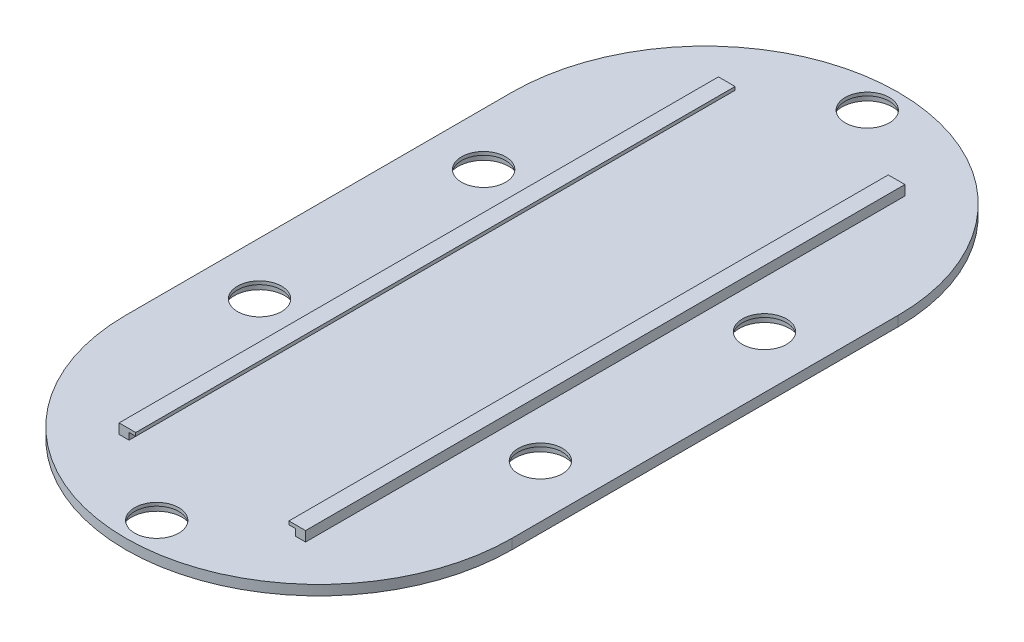
ISO-10303-21;
HEADER;
FILE_DESCRIPTION(('STEP AP214'),'2;1');
FILE_NAME('part.step','',(''),(''),'','','');
FILE_SCHEMA(('AUTOMOTIVE_DESIGN { 1 0 10303 214 1 1 1 1 }'));
ENDSEC;
DATA;
#1=APPLICATION_CONTEXT('core data for automotive mechanical design processes');
#2=APPLICATION_PROTOCOL_DEFINITION('international standard','automotive_design',2000,#1);
#3=PRODUCT_CONTEXT('',#1,'mechanical');
#4=PRODUCT('Part','Part','',(#3));
#5=PRODUCT_RELATED_PRODUCT_CATEGORY('part','',(#4));
#6=PRODUCT_DEFINITION_FORMATION('','',#4);
#7=PRODUCT_DEFINITION_CONTEXT('part definition',#1,'design');
#8=PRODUCT_DEFINITION('design','',#6,#7);
#9=PRODUCT_DEFINITION_SHAPE('','',#8);
#10=(LENGTH_UNIT() NAMED_UNIT(*) SI_UNIT(.MILLI.,.METRE.));
#11=(NAMED_UNIT(*) PLANE_ANGLE_UNIT() SI_UNIT($,.RADIAN.));
#12=(NAMED_UNIT(*) SI_UNIT($,.STERADIAN.) SOLID_ANGLE_UNIT());
#13=UNCERTAINTY_MEASURE_WITH_UNIT(LENGTH_MEASURE(1.E-05),#10,'distance_accuracy_value','');
#14=(GEOMETRIC_REPRESENTATION_CONTEXT(3) GLOBAL_UNCERTAINTY_ASSIGNED_CONTEXT((#13)) GLOBAL_UNIT_ASSIGNED_CONTEXT((#10,
#11,#12)) REPRESENTATION_CONTEXT('',''));
#15=CARTESIAN_POINT('',(0.,0.,0.));
#16=DIRECTION('',(0.,0.,1.));
#17=DIRECTION('',(1.,0.,0.));
#18=AXIS2_PLACEMENT_3D('',#15,#16,#17);
#19=CARTESIAN_POINT('',(0.,3.,58.));
#20=DIRECTION('',(0.,-1.,0.));
#21=DIRECTION('',(0.,0.,-1.));
#22=AXIS2_PLACEMENT_3D('',#19,#20,#21);
#23=PLANE('',#22);
#24=CARTESIAN_POINT('',(42.175,3.,33.6502523969275));
#25=DIRECTION('',(0.,1.,0.));
#26=DIRECTION('',(0.,0.,-1.));
#27=AXIS2_PLACEMENT_3D('',#24,#25,#26);
#28=CIRCLE('',#27,6.625);
#29=CARTESIAN_POINT('',(42.175,3.,27.0252523969275));
#30=VERTEX_POINT('',#29);
#31=EDGE_CURVE('E299',#30,#30,#28,.T.);
#32=ORIENTED_EDGE('',*,*,#31,.F.);
#33=EDGE_LOOP('',(#32));
#34=FACE_BOUND('',#33,.T.);
#35=CARTESIAN_POINT('',(0.,3.,106.699495206145));
#36=DIRECTION('',(0.,1.,0.));
#37=DIRECTION('',(0.,0.,-1.));
#38=AXIS2_PLACEMENT_3D('',#35,#36,#37);
#39=CIRCLE('',#38,6.62500000000002);
#40=CARTESIAN_POINT('',(0.,3.,100.074495206145));
#41=VERTEX_POINT('',#40);
#42=EDGE_CURVE('E303',#41,#41,#39,.T.);
#43=ORIENTED_EDGE('',*,*,#42,.F.);
#44=EDGE_LOOP('',(#43));
#45=FACE_BOUND('',#44,.T.);
#46=CARTESIAN_POINT('',(-42.175,3.,-33.6502523969275));
#47=DIRECTION('',(0.,1.,0.));
#48=DIRECTION('',(0.,0.,1.));
#49=AXIS2_PLACEMENT_3D('',#46,#47,#48);
#50=CIRCLE('',#49,6.62500000000001);
#51=CARTESIAN_POINT('',(-42.175,3.,-27.0252523969275));
#52=VERTEX_POINT('',#51);
#53=EDGE_CURVE('E307',#52,#52,#50,.T.);
#54=ORIENTED_EDGE('',*,*,#53,.F.);
#55=EDGE_LOOP('',(#54));
#56=FACE_BOUND('',#55,.T.);
#57=CARTESIAN_POINT('',(42.175,3.,-33.6502523969275));
#58=DIRECTION('',(0.,1.,0.));
#59=DIRECTION('',(0.,0.,1.));
#60=AXIS2_PLACEMENT_3D('',#57,#58,#59);
#61=CIRCLE('',#60,6.625);
#62=CARTESIAN_POINT('',(42.175,3.,-27.0252523969275));
#63=VERTEX_POINT('',#62);
#64=EDGE_CURVE('E311',#63,#63,#61,.T.);
#65=ORIENTED_EDGE('',*,*,#64,.F.);
#66=EDGE_LOOP('',(#65));
#67=FACE_BOUND('',#66,.T.);
#68=CARTESIAN_POINT('',(-42.175,3.,33.6502523969275));
#69=DIRECTION('',(0.,1.,0.));
#70=DIRECTION('',(0.,0.,-1.));
#71=AXIS2_PLACEMENT_3D('',#68,#69,#70);
#72=CIRCLE('',#71,6.62500000000001);
#73=CARTESIAN_POINT('',(-42.175,3.,27.0252523969275));
#74=VERTEX_POINT('',#73);
#75=EDGE_CURVE('E315',#74,#74,#72,.T.);
#76=ORIENTED_EDGE('',*,*,#75,.F.);
#77=EDGE_LOOP('',(#76));
#78=FACE_BOUND('',#77,.T.);
#79=CARTESIAN_POINT('',(0.,3.,-106.699495206145));
#80=DIRECTION('',(0.,1.,0.));
#81=DIRECTION('',(0.,0.,1.));
#82=AXIS2_PLACEMENT_3D('',#79,#80,#81);
#83=CIRCLE('',#82,6.62500000000002);
#84=CARTESIAN_POINT('',(0.,3.,-100.074495206145));
#85=VERTEX_POINT('',#84);
#86=EDGE_CURVE('E319',#85,#85,#83,.T.);
#87=ORIENTED_EDGE('',*,*,#86,.F.);
#88=EDGE_LOOP('',(#87));
#89=FACE_BOUND('',#88,.T.);
#90=CARTESIAN_POINT('',(0.,3.,58.));
#91=DIRECTION('',(0.,1.,0.));
#92=DIRECTION('',(0.,0.,-1.));
#93=AXIS2_PLACEMENT_3D('',#90,#91,#92);
#94=CIRCLE('',#93,58.);
#95=CARTESIAN_POINT('',(-58.,3.,58.));
#96=VERTEX_POINT('',#95);
#97=CARTESIAN_POINT('',(58.,3.,58.));
#98=VERTEX_POINT('',#97);
#99=EDGE_CURVE('E324',#96,#98,#94,.T.);
#100=ORIENTED_EDGE('',*,*,#99,.T.);
#101=DIRECTION('',(0.,0.,-1.));
#102=VECTOR('',#101,1.);
#103=CARTESIAN_POINT('',(58.,3.,58.));
#104=LINE('',#103,#102);
#105=CARTESIAN_POINT('',(58.,3.,-58.));
#106=VERTEX_POINT('',#105);
#107=EDGE_CURVE('E328',#98,#106,#104,.T.);
#108=ORIENTED_EDGE('',*,*,#107,.T.);
#109=CARTESIAN_POINT('',(0.,3.,-57.9999999999999));
#110=DIRECTION('',(0.,1.,0.));
#111=DIRECTION('',(0.,0.,-1.));
#112=AXIS2_PLACEMENT_3D('',#109,#110,#111);
#113=CIRCLE('',#112,58.);
#114=CARTESIAN_POINT('',(-58.,3.,-58.));
#115=VERTEX_POINT('',#114);
#116=EDGE_CURVE('E332',#106,#115,#113,.T.);
#117=ORIENTED_EDGE('',*,*,#116,.T.);
#118=DIRECTION('',(0.,0.,1.));
#119=VECTOR('',#118,1.);
#120=CARTESIAN_POINT('',(-58.,3.,58.));
#121=LINE('',#120,#119);
#122=EDGE_CURVE('E335',#115,#96,#121,.T.);
#123=ORIENTED_EDGE('',*,*,#122,.T.);
#124=EDGE_LOOP('',(#100,#108,#117,#123));
#125=FACE_BOUND('',#124,.T.);
#126=DIRECTION('',(0.,0.,-1.));
#127=VECTOR('',#126,1.);
#128=CARTESIAN_POINT('',(28.,3.,90.));
#129=LINE('',#128,#127);
#130=CARTESIAN_POINT('',(28.,3.,90.));
#131=VERTEX_POINT('',#130);
#132=CARTESIAN_POINT('',(28.,3.,-90.));
#133=VERTEX_POINT('',#132);
#134=EDGE_CURVE('E65',#131,#133,#129,.T.);
#135=ORIENTED_EDGE('',*,*,#134,.F.);
#136=DIRECTION('',(1.,0.,0.));
#137=VECTOR('',#136,1.);
#138=CARTESIAN_POINT('',(25.,3.,90.));
#139=LINE('',#138,#137);
#140=CARTESIAN_POINT('',(25.,3.,90.));
#141=VERTEX_POINT('',#140);
#142=EDGE_CURVE('E194',#141,#131,#139,.T.);
#143=ORIENTED_EDGE('',*,*,#142,.F.);
#144=DIRECTION('',(0.,0.,-1.));
#145=VECTOR('',#144,1.);
#146=CARTESIAN_POINT('',(25.,3.,90.));
#147=LINE('',#146,#145);
#148=CARTESIAN_POINT('',(25.,3.,-90.));
#149=VERTEX_POINT('',#148);
#150=EDGE_CURVE('E214',#141,#149,#147,.T.);
#151=ORIENTED_EDGE('',*,*,#150,.T.);
#152=DIRECTION('',(1.,0.,0.));
#153=VECTOR('',#152,1.);
#154=CARTESIAN_POINT('',(25.,3.,-90.));
#155=LINE('',#154,#153);
#156=EDGE_CURVE('E184',#149,#133,#155,.T.);
#157=ORIENTED_EDGE('',*,*,#156,.T.);
#158=EDGE_LOOP('',(#135,#143,#151,#157));
#159=FACE_BOUND('',#158,.T.);
#160=DIRECTION('',(1.,0.,0.));
#161=VECTOR('',#160,1.);
#162=CARTESIAN_POINT('',(-25.,3.,90.));
#163=LINE('',#162,#161);
#164=CARTESIAN_POINT('',(-28.,3.,90.));
#165=VERTEX_POINT('',#164);
#166=CARTESIAN_POINT('',(-25.,3.,90.));
#167=VERTEX_POINT('',#166);
#168=EDGE_CURVE('E434',#165,#167,#163,.T.);
#169=ORIENTED_EDGE('',*,*,#168,.F.);
#170=DIRECTION('',(0.,0.,-1.));
#171=VECTOR('',#170,1.);
#172=CARTESIAN_POINT('',(-28.,3.,90.));
#173=LINE('',#172,#171);
#174=CARTESIAN_POINT('',(-28.,3.,-90.));
#175=VERTEX_POINT('',#174);
#176=EDGE_CURVE('E190',#165,#175,#173,.T.);
#177=ORIENTED_EDGE('',*,*,#176,.T.);
#178=DIRECTION('',(1.,0.,0.));
#179=VECTOR('',#178,1.);
#180=CARTESIAN_POINT('',(-25.,3.,-90.));
#181=LINE('',#180,#179);
#182=CARTESIAN_POINT('',(-25.,3.,-90.));
#183=VERTEX_POINT('',#182);
#184=EDGE_CURVE('E458',#175,#183,#181,.T.);
#185=ORIENTED_EDGE('',*,*,#184,.T.);
#186=DIRECTION('',(0.,0.,-1.));
#187=VECTOR('',#186,1.);
#188=CARTESIAN_POINT('',(-25.,3.,90.));
#189=LINE('',#188,#187);
#190=EDGE_CURVE('E437',#167,#183,#189,.T.);
#191=ORIENTED_EDGE('',*,*,#190,.F.);
#192=EDGE_LOOP('',(#169,#177,#185,#191));
#193=FACE_BOUND('',#192,.T.);
#194=ADVANCED_FACE('F39',(#34,#45,#56,#67,#78,#89,#125,#159,#193),#23,.F.);
#195=CARTESIAN_POINT('',(0.,3.,-106.699495206145));
#196=DIRECTION('',(0.,-1.,0.));
#197=DIRECTION('',(0.,0.,-1.));
#198=AXIS2_PLACEMENT_3D('',#195,#196,#197);
#199=CYLINDRICAL_SURFACE('',#198,6.62500000000002);
#200=ORIENTED_EDGE('',*,*,#86,.T.);
#201=EDGE_LOOP('',(#200));
#202=FACE_BOUND('',#201,.T.);
#203=CARTESIAN_POINT('',(0.,2.,-106.699495206145));
#204=DIRECTION('',(0.,-1.,0.));
#205=DIRECTION('',(0.,0.,-1.));
#206=AXIS2_PLACEMENT_3D('',#203,#204,#205);
#207=CIRCLE('',#206,6.62500000000002);
#208=CARTESIAN_POINT('',(0.,2.,-113.324495206145));
#209=VERTEX_POINT('',#208);
#210=EDGE_CURVE('E43',#209,#209,#207,.T.);
#211=ORIENTED_EDGE('',*,*,#210,.T.);
#212=EDGE_LOOP('',(#211));
#213=FACE_BOUND('',#212,.T.);
#214=ADVANCED_FACE('F383',(#202,#213),#199,.F.);
#215=CARTESIAN_POINT('',(-42.175,3.,33.6502523969275));
#216=DIRECTION('',(0.,-1.,0.));
#217=DIRECTION('',(0.,0.,-1.));
#218=AXIS2_PLACEMENT_3D('',#215,#216,#217);
#219=CYLINDRICAL_SURFACE('',#218,6.62500000000001);
#220=ORIENTED_EDGE('',*,*,#75,.T.);
#221=EDGE_LOOP('',(#220));
#222=FACE_BOUND('',#221,.T.);
#223=CARTESIAN_POINT('',(-42.175,2.,33.6502523969275));
#224=DIRECTION('',(0.,-1.,0.));
#225=DIRECTION('',(0.,0.,-1.));
#226=AXIS2_PLACEMENT_3D('',#223,#224,#225);
#227=CIRCLE('',#226,6.62500000000001);
#228=CARTESIAN_POINT('',(-42.175,2.,27.0252523969275));
#229=VERTEX_POINT('',#228);
#230=EDGE_CURVE('E374',#229,#229,#227,.T.);
#231=ORIENTED_EDGE('',*,*,#230,.T.);
#232=EDGE_LOOP('',(#231));
#233=FACE_BOUND('',#232,.T.);
#234=ADVANCED_FACE('F573',(#222,#233),#219,.F.);
#235=CARTESIAN_POINT('',(42.175,3.,-33.6502523969275));
#236=DIRECTION('',(0.,-1.,0.));
#237=DIRECTION('',(0.,0.,-1.));
#238=AXIS2_PLACEMENT_3D('',#235,#236,#237);
#239=CYLINDRICAL_SURFACE('',#238,6.625);
#240=ORIENTED_EDGE('',*,*,#64,.T.);
#241=EDGE_LOOP('',(#240));
#242=FACE_BOUND('',#241,.T.);
#243=CARTESIAN_POINT('',(42.175,2.,-33.6502523969275));
#244=DIRECTION('',(0.,-1.,0.));
#245=DIRECTION('',(0.,0.,-1.));
#246=AXIS2_PLACEMENT_3D('',#243,#244,#245);
#247=CIRCLE('',#246,6.625);
#248=CARTESIAN_POINT('',(42.175,2.,-40.2752523969275));
#249=VERTEX_POINT('',#248);
#250=EDGE_CURVE('E371',#249,#249,#247,.T.);
#251=ORIENTED_EDGE('',*,*,#250,.T.);
#252=EDGE_LOOP('',(#251));
#253=FACE_BOUND('',#252,.T.);
#254=ADVANCED_FACE('F569',(#242,#253),#239,.F.);
#255=CARTESIAN_POINT('',(-42.175,3.,-33.6502523969275));
#256=DIRECTION('',(0.,-1.,0.));
#257=DIRECTION('',(0.,0.,-1.));
#258=AXIS2_PLACEMENT_3D('',#255,#256,#257);
#259=CYLINDRICAL_SURFACE('',#258,6.62500000000001);
#260=ORIENTED_EDGE('',*,*,#53,.T.);
#261=EDGE_LOOP('',(#260));
#262=FACE_BOUND('',#261,.T.);
#263=CARTESIAN_POINT('',(-42.175,2.,-33.6502523969275));
#264=DIRECTION('',(0.,-1.,0.));
#265=DIRECTION('',(0.,0.,-1.));
#266=AXIS2_PLACEMENT_3D('',#263,#264,#265);
#267=CIRCLE('',#266,6.62500000000001);
#268=CARTESIAN_POINT('',(-42.175,2.,-40.2752523969275));
#269=VERTEX_POINT('',#268);
#270=EDGE_CURVE('E367',#269,#269,#267,.T.);
#271=ORIENTED_EDGE('',*,*,#270,.T.);
#272=EDGE_LOOP('',(#271));
#273=FACE_BOUND('',#272,.T.);
#274=ADVANCED_FACE('F565',(#262,#273),#259,.F.);
#275=CARTESIAN_POINT('',(0.,3.,106.699495206145));
#276=DIRECTION('',(0.,-1.,0.));
#277=DIRECTION('',(0.,0.,-1.));
#278=AXIS2_PLACEMENT_3D('',#275,#276,#277);
#279=CYLINDRICAL_SURFACE('',#278,6.62500000000002);
#280=ORIENTED_EDGE('',*,*,#42,.T.);
#281=EDGE_LOOP('',(#280));
#282=FACE_BOUND('',#281,.T.);
#283=CARTESIAN_POINT('',(0.,2.,106.699495206145));
#284=DIRECTION('',(0.,-1.,0.));
#285=DIRECTION('',(0.,0.,-1.));
#286=AXIS2_PLACEMENT_3D('',#283,#284,#285);
#287=CIRCLE('',#286,6.62500000000002);
#288=CARTESIAN_POINT('',(0.,2.,100.074495206145));
#289=VERTEX_POINT('',#288);
#290=EDGE_CURVE('E363',#289,#289,#287,.T.);
#291=ORIENTED_EDGE('',*,*,#290,.T.);
#292=EDGE_LOOP('',(#291));
#293=FACE_BOUND('',#292,.T.);
#294=ADVANCED_FACE('F561',(#282,#293),#279,.F.);
#295=CARTESIAN_POINT('',(42.175,3.,33.6502523969275));
#296=DIRECTION('',(0.,-1.,0.));
#297=DIRECTION('',(0.,0.,-1.));
#298=AXIS2_PLACEMENT_3D('',#295,#296,#297);
#299=CYLINDRICAL_SURFACE('',#298,6.625);
#300=ORIENTED_EDGE('',*,*,#31,.T.);
#301=EDGE_LOOP('',(#300));
#302=FACE_BOUND('',#301,.T.);
#303=CARTESIAN_POINT('',(42.175,2.,33.6502523969275));
#304=DIRECTION('',(0.,-1.,0.));
#305=DIRECTION('',(0.,0.,-1.));
#306=AXIS2_PLACEMENT_3D('',#303,#304,#305);
#307=CIRCLE('',#306,6.625);
#308=CARTESIAN_POINT('',(42.175,2.,27.0252523969275));
#309=VERTEX_POINT('',#308);
#310=EDGE_CURVE('E295',#309,#309,#307,.T.);
#311=ORIENTED_EDGE('',*,*,#310,.T.);
#312=EDGE_LOOP('',(#311));
#313=FACE_BOUND('',#312,.T.);
#314=ADVANCED_FACE('F402',(#302,#313),#299,.F.);
#315=CARTESIAN_POINT('',(0.,0.,58.));
#316=DIRECTION('',(0.,-1.,0.));
#317=DIRECTION('',(0.,0.,-1.));
#318=AXIS2_PLACEMENT_3D('',#315,#316,#317);
#319=PLANE('',#318);
#320=CARTESIAN_POINT('',(-42.175,0.,33.6502523969275));
#321=DIRECTION('',(0.,-1.,0.));
#322=DIRECTION('',(0.,0.,-1.));
#323=AXIS2_PLACEMENT_3D('',#320,#321,#322);
#324=CIRCLE('',#323,7.6);
#325=CARTESIAN_POINT('',(-42.175,0.,26.0502523969275));
#326=VERTEX_POINT('',#325);
#327=EDGE_CURVE('E255',#326,#326,#324,.T.);
#328=ORIENTED_EDGE('',*,*,#327,.F.);
#329=EDGE_LOOP('',(#328));
#330=FACE_BOUND('',#329,.T.);
#331=CARTESIAN_POINT('',(0.,0.,106.699495206145));
#332=DIRECTION('',(0.,-1.,0.));
#333=DIRECTION('',(0.,0.,-1.));
#334=AXIS2_PLACEMENT_3D('',#331,#332,#333);
#335=CIRCLE('',#334,7.6);
#336=CARTESIAN_POINT('',(0.,0.,99.0994952061449));
#337=VERTEX_POINT('',#336);
#338=EDGE_CURVE('E264',#337,#337,#335,.T.);
#339=ORIENTED_EDGE('',*,*,#338,.F.);
#340=EDGE_LOOP('',(#339));
#341=FACE_BOUND('',#340,.T.);
#342=CARTESIAN_POINT('',(42.175,0.,33.6502523969275));
#343=DIRECTION('',(0.,-1.,0.));
#344=DIRECTION('',(0.,0.,-1.));
#345=AXIS2_PLACEMENT_3D('',#342,#343,#344);
#346=CIRCLE('',#345,7.6);
#347=CARTESIAN_POINT('',(42.175,0.,26.0502523969275));
#348=VERTEX_POINT('',#347);
#349=EDGE_CURVE('E263',#348,#348,#346,.T.);
#350=ORIENTED_EDGE('',*,*,#349,.F.);
#351=EDGE_LOOP('',(#350));
#352=FACE_BOUND('',#351,.T.);
#353=CARTESIAN_POINT('',(0.,0.,-106.699495206145));
#354=DIRECTION('',(0.,-1.,0.));
#355=DIRECTION('',(0.,0.,-1.));
#356=AXIS2_PLACEMENT_3D('',#353,#354,#355);
#357=CIRCLE('',#356,7.6);
#358=CARTESIAN_POINT('',(0.,0.,-114.299495206145));
#359=VERTEX_POINT('',#358);
#360=EDGE_CURVE('E280',#359,#359,#357,.T.);
#361=ORIENTED_EDGE('',*,*,#360,.F.);
#362=EDGE_LOOP('',(#361));
#363=FACE_BOUND('',#362,.T.);
#364=CARTESIAN_POINT('',(42.175,0.,-33.6502523969275));
#365=DIRECTION('',(0.,-1.,0.));
#366=DIRECTION('',(0.,0.,-1.));
#367=AXIS2_PLACEMENT_3D('',#364,#365,#366);
#368=CIRCLE('',#367,7.6);
#369=CARTESIAN_POINT('',(42.175,0.,-41.2502523969275));
#370=VERTEX_POINT('',#369);
#371=EDGE_CURVE('E250',#370,#370,#368,.T.);
#372=ORIENTED_EDGE('',*,*,#371,.F.);
#373=EDGE_LOOP('',(#372));
#374=FACE_BOUND('',#373,.T.);
#375=CARTESIAN_POINT('',(-42.175,0.,-33.6502523969275));
#376=DIRECTION('',(0.,-1.,0.));
#377=DIRECTION('',(0.,0.,-1.));
#378=AXIS2_PLACEMENT_3D('',#375,#376,#377);
#379=CIRCLE('',#378,7.6);
#380=CARTESIAN_POINT('',(-42.175,0.,-41.2502523969275));
#381=VERTEX_POINT('',#380);
#382=EDGE_CURVE('E279',#381,#381,#379,.T.);
#383=ORIENTED_EDGE('',*,*,#382,.F.);
#384=EDGE_LOOP('',(#383));
#385=FACE_BOUND('',#384,.T.);
#386=CARTESIAN_POINT('',(0.,0.,58.));
#387=DIRECTION('',(0.,1.,0.));
#388=DIRECTION('',(0.,0.,-1.));
#389=AXIS2_PLACEMENT_3D('',#386,#387,#388);
#390=CIRCLE('',#389,58.);
#391=CARTESIAN_POINT('',(-58.,0.,58.));
#392=VERTEX_POINT('',#391);
#393=CARTESIAN_POINT('',(58.,0.,58.));
#394=VERTEX_POINT('',#393);
#395=EDGE_CURVE('E323',#392,#394,#390,.T.);
#396=ORIENTED_EDGE('',*,*,#395,.F.);
#397=DIRECTION('',(0.,0.,1.));
#398=VECTOR('',#397,1.);
#399=CARTESIAN_POINT('',(-58.,0.,58.));
#400=LINE('',#399,#398);
#401=CARTESIAN_POINT('',(-58.,0.,-58.));
#402=VERTEX_POINT('',#401);
#403=EDGE_CURVE('E329',#402,#392,#400,.T.);
#404=ORIENTED_EDGE('',*,*,#403,.F.);
#405=CARTESIAN_POINT('',(0.,0.,-57.9999999999999));
#406=DIRECTION('',(0.,1.,0.));
#407=DIRECTION('',(0.,0.,-1.));
#408=AXIS2_PLACEMENT_3D('',#405,#406,#407);
#409=CIRCLE('',#408,58.);
#410=CARTESIAN_POINT('',(58.,0.,-58.));
#411=VERTEX_POINT('',#410);
#412=EDGE_CURVE('E345',#411,#402,#409,.T.);
#413=ORIENTED_EDGE('',*,*,#412,.F.);
#414=DIRECTION('',(0.,0.,-1.));
#415=VECTOR('',#414,1.);
#416=CARTESIAN_POINT('',(58.,0.,58.));
#417=LINE('',#416,#415);
#418=EDGE_CURVE('E342',#394,#411,#417,.T.);
#419=ORIENTED_EDGE('',*,*,#418,.F.);
#420=EDGE_LOOP('',(#396,#404,#413,#419));
#421=FACE_BOUND('',#420,.T.);
#422=ADVANCED_FACE('F399',(#330,#341,#352,#363,#374,#385,#421),#319,.T.);
#423=CARTESIAN_POINT('',(0.,3.,58.));
#424=DIRECTION('',(0.,-1.,0.));
#425=DIRECTION('',(0.,0.,-1.));
#426=AXIS2_PLACEMENT_3D('',#423,#424,#425);
#427=CYLINDRICAL_SURFACE('',#426,58.);
#428=ORIENTED_EDGE('',*,*,#395,.T.);
#429=DIRECTION('',(0.,-1.,0.));
#430=VECTOR('',#429,1.);
#431=CARTESIAN_POINT('',(58.,3.,58.));
#432=LINE('',#431,#430);
#433=EDGE_CURVE('E11',#98,#394,#432,.T.);
#434=ORIENTED_EDGE('',*,*,#433,.F.);
#435=ORIENTED_EDGE('',*,*,#99,.F.);
#436=DIRECTION('',(0.,-1.,0.));
#437=VECTOR('',#436,1.);
#438=CARTESIAN_POINT('',(-58.,3.,58.));
#439=LINE('',#438,#437);
#440=EDGE_CURVE('E338',#96,#392,#439,.T.);
#441=ORIENTED_EDGE('',*,*,#440,.T.);
#442=EDGE_LOOP('',(#428,#434,#435,#441));
#443=FACE_BOUND('',#442,.T.);
#444=ADVANCED_FACE('F41',(#443),#427,.T.);
#445=CARTESIAN_POINT('',(58.,3.,58.));
#446=DIRECTION('',(-1.,0.,0.));
#447=DIRECTION('',(0.,0.,1.));
#448=AXIS2_PLACEMENT_3D('',#445,#446,#447);
#449=PLANE('',#448);
#450=ORIENTED_EDGE('',*,*,#418,.T.);
#451=DIRECTION('',(0.,-1.,0.));
#452=VECTOR('',#451,1.);
#453=CARTESIAN_POINT('',(58.,3.,-58.));
#454=LINE('',#453,#452);
#455=EDGE_CURVE('E49',#106,#411,#454,.T.);
#456=ORIENTED_EDGE('',*,*,#455,.F.);
#457=ORIENTED_EDGE('',*,*,#107,.F.);
#458=ORIENTED_EDGE('',*,*,#433,.T.);
#459=EDGE_LOOP('',(#450,#456,#457,#458));
#460=FACE_BOUND('',#459,.T.);
#461=ADVANCED_FACE('F425',(#460),#449,.F.);
#462=CARTESIAN_POINT('',(0.,3.,-57.9999999999999));
#463=DIRECTION('',(0.,-1.,0.));
#464=DIRECTION('',(0.,0.,-1.));
#465=AXIS2_PLACEMENT_3D('',#462,#463,#464);
#466=CYLINDRICAL_SURFACE('',#465,58.);
#467=ORIENTED_EDGE('',*,*,#412,.T.);
#468=DIRECTION('',(0.,-1.,0.));
#469=VECTOR('',#468,1.);
#470=CARTESIAN_POINT('',(-58.,3.,-58.));
#471=LINE('',#470,#469);
#472=EDGE_CURVE('E353',#115,#402,#471,.T.);
#473=ORIENTED_EDGE('',*,*,#472,.F.);
#474=ORIENTED_EDGE('',*,*,#116,.F.);
#475=ORIENTED_EDGE('',*,*,#455,.T.);
#476=EDGE_LOOP('',(#467,#473,#474,#475));
#477=FACE_BOUND('',#476,.T.);
#478=ADVANCED_FACE('F422',(#477),#466,.T.);
#479=CARTESIAN_POINT('',(-58.,3.,58.));
#480=DIRECTION('',(1.,0.,0.));
#481=DIRECTION('',(0.,0.,-1.));
#482=AXIS2_PLACEMENT_3D('',#479,#480,#481);
#483=PLANE('',#482);
#484=ORIENTED_EDGE('',*,*,#403,.T.);
#485=ORIENTED_EDGE('',*,*,#440,.F.);
#486=ORIENTED_EDGE('',*,*,#122,.F.);
#487=ORIENTED_EDGE('',*,*,#472,.T.);
#488=EDGE_LOOP('',(#484,#485,#486,#487));
#489=FACE_BOUND('',#488,.T.);
#490=ADVANCED_FACE('F418',(#489),#483,.F.);
#491=CARTESIAN_POINT('',(42.175,2.,33.6502523969275));
#492=DIRECTION('',(0.,-1.,0.));
#493=DIRECTION('',(0.,0.,-1.));
#494=AXIS2_PLACEMENT_3D('',#491,#492,#493);
#495=CYLINDRICAL_SURFACE('',#494,7.6);
#496=CARTESIAN_POINT('',(42.175,2.,33.6502523969275));
#497=DIRECTION('',(0.,-1.,0.));
#498=DIRECTION('',(0.,0.,-1.));
#499=AXIS2_PLACEMENT_3D('',#496,#497,#498);
#500=CIRCLE('',#499,7.6);
#501=CARTESIAN_POINT('',(42.175,2.,26.0502523969275));
#502=VERTEX_POINT('',#501);
#503=EDGE_CURVE('E284',#502,#502,#500,.T.);
#504=ORIENTED_EDGE('',*,*,#503,.F.);
#505=EDGE_LOOP('',(#504));
#506=FACE_BOUND('',#505,.T.);
#507=ORIENTED_EDGE('',*,*,#349,.T.);
#508=EDGE_LOOP('',(#507));
#509=FACE_BOUND('',#508,.T.);
#510=ADVANCED_FACE('F548',(#506,#509),#495,.F.);
#511=CARTESIAN_POINT('',(42.175,2.,33.6502523969275));
#512=DIRECTION('',(0.,-1.,0.));
#513=DIRECTION('',(0.,0.,-1.));
#514=AXIS2_PLACEMENT_3D('',#511,#512,#513);
#515=PLANE('',#514);
#516=ORIENTED_EDGE('',*,*,#310,.F.);
#517=EDGE_LOOP('',(#516));
#518=FACE_BOUND('',#517,.T.);
#519=ORIENTED_EDGE('',*,*,#503,.T.);
#520=EDGE_LOOP('',(#519));
#521=FACE_BOUND('',#520,.T.);
#522=ADVANCED_FACE('F538',(#518,#521),#515,.T.);
#523=CARTESIAN_POINT('',(0.,2.,106.699495206145));
#524=DIRECTION('',(0.,-1.,0.));
#525=DIRECTION('',(0.,0.,-1.));
#526=AXIS2_PLACEMENT_3D('',#523,#524,#525);
#527=CYLINDRICAL_SURFACE('',#526,7.6);
#528=CARTESIAN_POINT('',(0.,2.,106.699495206145));
#529=DIRECTION('',(0.,-1.,0.));
#530=DIRECTION('',(0.,0.,-1.));
#531=AXIS2_PLACEMENT_3D('',#528,#529,#530);
#532=CIRCLE('',#531,7.6);
#533=CARTESIAN_POINT('',(0.,2.,99.0994952061449));
#534=VERTEX_POINT('',#533);
#535=EDGE_CURVE('E259',#534,#534,#532,.T.);
#536=ORIENTED_EDGE('',*,*,#535,.F.);
#537=EDGE_LOOP('',(#536));
#538=FACE_BOUND('',#537,.T.);
#539=ORIENTED_EDGE('',*,*,#338,.T.);
#540=EDGE_LOOP('',(#539));
#541=FACE_BOUND('',#540,.T.);
#542=ADVANCED_FACE('F534',(#538,#541),#527,.F.);
#543=CARTESIAN_POINT('',(0.,2.,106.699495206145));
#544=DIRECTION('',(0.,-1.,0.));
#545=DIRECTION('',(0.,0.,-1.));
#546=AXIS2_PLACEMENT_3D('',#543,#544,#545);
#547=PLANE('',#546);
#548=ORIENTED_EDGE('',*,*,#290,.F.);
#549=EDGE_LOOP('',(#548));
#550=FACE_BOUND('',#549,.T.);
#551=ORIENTED_EDGE('',*,*,#535,.T.);
#552=EDGE_LOOP('',(#551));
#553=FACE_BOUND('',#552,.T.);
#554=ADVANCED_FACE('F530',(#550,#553),#547,.T.);
#555=CARTESIAN_POINT('',(-42.175,2.,-33.6502523969275));
#556=DIRECTION('',(0.,-1.,0.));
#557=DIRECTION('',(0.,0.,-1.));
#558=AXIS2_PLACEMENT_3D('',#555,#556,#557);
#559=CYLINDRICAL_SURFACE('',#558,7.6);
#560=CARTESIAN_POINT('',(-42.175,2.,-33.6502523969275));
#561=DIRECTION('',(0.,-1.,0.));
#562=DIRECTION('',(0.,0.,-1.));
#563=AXIS2_PLACEMENT_3D('',#560,#561,#562);
#564=CIRCLE('',#563,7.6);
#565=CARTESIAN_POINT('',(-42.175,2.,-41.2502523969275));
#566=VERTEX_POINT('',#565);
#567=EDGE_CURVE('E291',#566,#566,#564,.T.);
#568=ORIENTED_EDGE('',*,*,#567,.F.);
#569=EDGE_LOOP('',(#568));
#570=FACE_BOUND('',#569,.T.);
#571=ORIENTED_EDGE('',*,*,#382,.T.);
#572=EDGE_LOOP('',(#571));
#573=FACE_BOUND('',#572,.T.);
#574=ADVANCED_FACE('F533',(#570,#573),#559,.F.);
#575=CARTESIAN_POINT('',(-42.175,2.,-33.6502523969275));
#576=DIRECTION('',(0.,-1.,0.));
#577=DIRECTION('',(0.,0.,-1.));
#578=AXIS2_PLACEMENT_3D('',#575,#576,#577);
#579=PLANE('',#578);
#580=ORIENTED_EDGE('',*,*,#270,.F.);
#581=EDGE_LOOP('',(#580));
#582=FACE_BOUND('',#581,.T.);
#583=ORIENTED_EDGE('',*,*,#567,.T.);
#584=EDGE_LOOP('',(#583));
#585=FACE_BOUND('',#584,.T.);
#586=ADVANCED_FACE('F528',(#582,#585),#579,.T.);
#587=CARTESIAN_POINT('',(42.175,2.,-33.6502523969275));
#588=DIRECTION('',(0.,-1.,0.));
#589=DIRECTION('',(0.,0.,-1.));
#590=AXIS2_PLACEMENT_3D('',#587,#588,#589);
#591=CYLINDRICAL_SURFACE('',#590,7.6);
#592=CARTESIAN_POINT('',(42.175,2.,-33.6502523969275));
#593=DIRECTION('',(0.,-1.,0.));
#594=DIRECTION('',(0.,0.,-1.));
#595=AXIS2_PLACEMENT_3D('',#592,#593,#594);
#596=CIRCLE('',#595,7.6);
#597=CARTESIAN_POINT('',(42.175,2.,-41.2502523969275));
#598=VERTEX_POINT('',#597);
#599=EDGE_CURVE('E251',#598,#598,#596,.T.);
#600=ORIENTED_EDGE('',*,*,#599,.F.);
#601=EDGE_LOOP('',(#600));
#602=FACE_BOUND('',#601,.T.);
#603=ORIENTED_EDGE('',*,*,#371,.T.);
#604=EDGE_LOOP('',(#603));
#605=FACE_BOUND('',#604,.T.);
#606=ADVANCED_FACE('F524',(#602,#605),#591,.F.);
#607=CARTESIAN_POINT('',(42.175,2.,-33.6502523969275));
#608=DIRECTION('',(0.,-1.,0.));
#609=DIRECTION('',(0.,0.,-1.));
#610=AXIS2_PLACEMENT_3D('',#607,#608,#609);
#611=PLANE('',#610);
#612=ORIENTED_EDGE('',*,*,#250,.F.);
#613=EDGE_LOOP('',(#612));
#614=FACE_BOUND('',#613,.T.);
#615=ORIENTED_EDGE('',*,*,#599,.T.);
#616=EDGE_LOOP('',(#615));
#617=FACE_BOUND('',#616,.T.);
#618=ADVANCED_FACE('F520',(#614,#617),#611,.T.);
#619=CARTESIAN_POINT('',(-42.175,2.,33.6502523969275));
#620=DIRECTION('',(0.,-1.,0.));
#621=DIRECTION('',(0.,0.,-1.));
#622=AXIS2_PLACEMENT_3D('',#619,#620,#621);
#623=CYLINDRICAL_SURFACE('',#622,7.6);
#624=CARTESIAN_POINT('',(-42.175,2.,33.6502523969275));
#625=DIRECTION('',(0.,-1.,0.));
#626=DIRECTION('',(0.,0.,-1.));
#627=AXIS2_PLACEMENT_3D('',#624,#625,#626);
#628=CIRCLE('',#627,7.6);
#629=CARTESIAN_POINT('',(-42.175,2.,26.0502523969275));
#630=VERTEX_POINT('',#629);
#631=EDGE_CURVE('E268',#630,#630,#628,.T.);
#632=ORIENTED_EDGE('',*,*,#631,.F.);
#633=EDGE_LOOP('',(#632));
#634=FACE_BOUND('',#633,.T.);
#635=ORIENTED_EDGE('',*,*,#327,.T.);
#636=EDGE_LOOP('',(#635));
#637=FACE_BOUND('',#636,.T.);
#638=ADVANCED_FACE('F523',(#634,#637),#623,.F.);
#639=CARTESIAN_POINT('',(-42.175,2.,33.6502523969275));
#640=DIRECTION('',(0.,-1.,0.));
#641=DIRECTION('',(0.,0.,-1.));
#642=AXIS2_PLACEMENT_3D('',#639,#640,#641);
#643=PLANE('',#642);
#644=ORIENTED_EDGE('',*,*,#230,.F.);
#645=EDGE_LOOP('',(#644));
#646=FACE_BOUND('',#645,.T.);
#647=ORIENTED_EDGE('',*,*,#631,.T.);
#648=EDGE_LOOP('',(#647));
#649=FACE_BOUND('',#648,.T.);
#650=ADVANCED_FACE('F395',(#646,#649),#643,.T.);
#651=CARTESIAN_POINT('',(0.,2.,-106.699495206145));
#652=DIRECTION('',(0.,-1.,0.));
#653=DIRECTION('',(0.,0.,-1.));
#654=AXIS2_PLACEMENT_3D('',#651,#652,#653);
#655=CYLINDRICAL_SURFACE('',#654,7.6);
#656=CARTESIAN_POINT('',(0.,2.,-106.699495206145));
#657=DIRECTION('',(0.,-1.,0.));
#658=DIRECTION('',(0.,0.,-1.));
#659=AXIS2_PLACEMENT_3D('',#656,#657,#658);
#660=CIRCLE('',#659,7.6);
#661=CARTESIAN_POINT('',(0.,2.,-114.299495206145));
#662=VERTEX_POINT('',#661);
#663=EDGE_CURVE('E275',#662,#662,#660,.T.);
#664=ORIENTED_EDGE('',*,*,#663,.F.);
#665=EDGE_LOOP('',(#664));
#666=FACE_BOUND('',#665,.T.);
#667=ORIENTED_EDGE('',*,*,#360,.T.);
#668=EDGE_LOOP('',(#667));
#669=FACE_BOUND('',#668,.T.);
#670=ADVANCED_FACE('F389',(#666,#669),#655,.F.);
#671=CARTESIAN_POINT('',(0.,2.,-106.699495206145));
#672=DIRECTION('',(0.,-1.,0.));
#673=DIRECTION('',(0.,0.,-1.));
#674=AXIS2_PLACEMENT_3D('',#671,#672,#673);
#675=PLANE('',#674);
#676=ORIENTED_EDGE('',*,*,#210,.F.);
#677=EDGE_LOOP('',(#676));
#678=FACE_BOUND('',#677,.T.);
#679=ORIENTED_EDGE('',*,*,#663,.T.);
#680=EDGE_LOOP('',(#679));
#681=FACE_BOUND('',#680,.T.);
#682=ADVANCED_FACE('F385',(#678,#681),#675,.T.);
#683=CARTESIAN_POINT('',(28.,3.,90.));
#684=DIRECTION('',(-1.,0.,0.));
#685=DIRECTION('',(0.,0.,1.));
#686=AXIS2_PLACEMENT_3D('',#683,#684,#685);
#687=PLANE('',#686);
#688=DIRECTION('',(0.,1.,0.));
#689=VECTOR('',#688,1.);
#690=CARTESIAN_POINT('',(28.,3.,-90.));
#691=LINE('',#690,#689);
#692=CARTESIAN_POINT('',(28.,6.,-90.));
#693=VERTEX_POINT('',#692);
#694=EDGE_CURVE('E188',#133,#693,#691,.T.);
#695=ORIENTED_EDGE('',*,*,#694,.T.);
#696=DIRECTION('',(0.,0.,-1.));
#697=VECTOR('',#696,1.);
#698=CARTESIAN_POINT('',(28.,6.,90.));
#699=LINE('',#698,#697);
#700=CARTESIAN_POINT('',(28.,6.,90.));
#701=VERTEX_POINT('',#700);
#702=EDGE_CURVE('E244',#701,#693,#699,.T.);
#703=ORIENTED_EDGE('',*,*,#702,.F.);
#704=DIRECTION('',(0.,1.,0.));
#705=VECTOR('',#704,1.);
#706=CARTESIAN_POINT('',(28.,3.,90.));
#707=LINE('',#706,#705);
#708=EDGE_CURVE('E198',#131,#701,#707,.T.);
#709=ORIENTED_EDGE('',*,*,#708,.F.);
#710=ORIENTED_EDGE('',*,*,#134,.T.);
#711=EDGE_LOOP('',(#695,#703,#709,#710));
#712=FACE_BOUND('',#711,.T.);
#713=ADVANCED_FACE('F388',(#712),#687,.F.);
#714=CARTESIAN_POINT('',(28.,6.,90.));
#715=DIRECTION('',(0.,-1.,0.));
#716=DIRECTION('',(1.,0.,0.));
#717=AXIS2_PLACEMENT_3D('',#714,#715,#716);
#718=PLANE('',#717);
#719=DIRECTION('',(-1.,0.,0.));
#720=VECTOR('',#719,1.);
#721=CARTESIAN_POINT('',(28.,6.,-90.));
#722=LINE('',#721,#720);
#723=CARTESIAN_POINT('',(23.,6.,-90.));
#724=VERTEX_POINT('',#723);
#725=EDGE_CURVE('E218',#693,#724,#722,.T.);
#726=ORIENTED_EDGE('',*,*,#725,.T.);
#727=DIRECTION('',(0.,0.,-1.));
#728=VECTOR('',#727,1.);
#729=CARTESIAN_POINT('',(23.,6.,90.));
#730=LINE('',#729,#728);
#731=CARTESIAN_POINT('',(23.,6.,90.));
#732=VERTEX_POINT('',#731);
#733=EDGE_CURVE('E240',#732,#724,#730,.T.);
#734=ORIENTED_EDGE('',*,*,#733,.F.);
#735=DIRECTION('',(-1.,0.,0.));
#736=VECTOR('',#735,1.);
#737=CARTESIAN_POINT('',(28.,6.,90.));
#738=LINE('',#737,#736);
#739=EDGE_CURVE('E202',#701,#732,#738,.T.);
#740=ORIENTED_EDGE('',*,*,#739,.F.);
#741=ORIENTED_EDGE('',*,*,#702,.T.);
#742=EDGE_LOOP('',(#726,#734,#740,#741));
#743=FACE_BOUND('',#742,.T.);
#744=ADVANCED_FACE('F512',(#743),#718,.F.);
#745=CARTESIAN_POINT('',(23.,6.,90.));
#746=DIRECTION('',(1.,0.,0.));
#747=DIRECTION('',(0.,0.,-1.));
#748=AXIS2_PLACEMENT_3D('',#745,#746,#747);
#749=PLANE('',#748);
#750=DIRECTION('',(0.,-1.,0.));
#751=VECTOR('',#750,1.);
#752=CARTESIAN_POINT('',(23.,6.,-90.));
#753=LINE('',#752,#751);
#754=CARTESIAN_POINT('',(23.,5.,-90.));
#755=VERTEX_POINT('',#754);
#756=EDGE_CURVE('E221',#724,#755,#753,.T.);
#757=ORIENTED_EDGE('',*,*,#756,.T.);
#758=DIRECTION('',(0.,0.,-1.));
#759=VECTOR('',#758,1.);
#760=CARTESIAN_POINT('',(23.,5.,90.));
#761=LINE('',#760,#759);
#762=CARTESIAN_POINT('',(23.,5.,90.));
#763=VERTEX_POINT('',#762);
#764=EDGE_CURVE('E236',#763,#755,#761,.T.);
#765=ORIENTED_EDGE('',*,*,#764,.F.);
#766=DIRECTION('',(0.,-1.,0.));
#767=VECTOR('',#766,1.);
#768=CARTESIAN_POINT('',(23.,6.,90.));
#769=LINE('',#768,#767);
#770=EDGE_CURVE('E205',#732,#763,#769,.T.);
#771=ORIENTED_EDGE('',*,*,#770,.F.);
#772=ORIENTED_EDGE('',*,*,#733,.T.);
#773=EDGE_LOOP('',(#757,#765,#771,#772));
#774=FACE_BOUND('',#773,.T.);
#775=ADVANCED_FACE('F508',(#774),#749,.F.);
#776=CARTESIAN_POINT('',(23.,5.,90.));
#777=DIRECTION('',(0.,1.,0.));
#778=DIRECTION('',(-1.,0.,0.));
#779=AXIS2_PLACEMENT_3D('',#776,#777,#778);
#780=PLANE('',#779);
#781=DIRECTION('',(1.,0.,0.));
#782=VECTOR('',#781,1.);
#783=CARTESIAN_POINT('',(23.,5.,-90.));
#784=LINE('',#783,#782);
#785=CARTESIAN_POINT('',(25.,5.,-90.));
#786=VERTEX_POINT('',#785);
#787=EDGE_CURVE('E224',#755,#786,#784,.T.);
#788=ORIENTED_EDGE('',*,*,#787,.T.);
#789=DIRECTION('',(0.,0.,-1.));
#790=VECTOR('',#789,1.);
#791=CARTESIAN_POINT('',(25.,5.,90.));
#792=LINE('',#791,#790);
#793=CARTESIAN_POINT('',(25.,5.,90.));
#794=VERTEX_POINT('',#793);
#795=EDGE_CURVE('E232',#794,#786,#792,.T.);
#796=ORIENTED_EDGE('',*,*,#795,.F.);
#797=DIRECTION('',(1.,0.,0.));
#798=VECTOR('',#797,1.);
#799=CARTESIAN_POINT('',(23.,5.,90.));
#800=LINE('',#799,#798);
#801=EDGE_CURVE('E208',#763,#794,#800,.T.);
#802=ORIENTED_EDGE('',*,*,#801,.F.);
#803=ORIENTED_EDGE('',*,*,#764,.T.);
#804=EDGE_LOOP('',(#788,#796,#802,#803));
#805=FACE_BOUND('',#804,.T.);
#806=ADVANCED_FACE('F504',(#805),#780,.F.);
#807=CARTESIAN_POINT('',(25.,5.,90.));
#808=DIRECTION('',(1.,0.,0.));
#809=DIRECTION('',(0.,0.,-1.));
#810=AXIS2_PLACEMENT_3D('',#807,#808,#809);
#811=PLANE('',#810);
#812=DIRECTION('',(0.,-1.,0.));
#813=VECTOR('',#812,1.);
#814=CARTESIAN_POINT('',(25.,5.,-90.));
#815=LINE('',#814,#813);
#816=EDGE_CURVE('E199',#786,#149,#815,.T.);
#817=ORIENTED_EDGE('',*,*,#816,.T.);
#818=ORIENTED_EDGE('',*,*,#150,.F.);
#819=DIRECTION('',(0.,-1.,0.));
#820=VECTOR('',#819,1.);
#821=CARTESIAN_POINT('',(25.,5.,90.));
#822=LINE('',#821,#820);
#823=EDGE_CURVE('E211',#794,#141,#822,.T.);
#824=ORIENTED_EDGE('',*,*,#823,.F.);
#825=ORIENTED_EDGE('',*,*,#795,.T.);
#826=EDGE_LOOP('',(#817,#818,#824,#825));
#827=FACE_BOUND('',#826,.T.);
#828=ADVANCED_FACE('F497',(#827),#811,.F.);
#829=CARTESIAN_POINT('',(0.,0.,90.));
#830=DIRECTION('',(0.,0.,1.));
#831=DIRECTION('',(1.,0.,0.));
#832=AXIS2_PLACEMENT_3D('',#829,#830,#831);
#833=PLANE('',#832);
#834=ORIENTED_EDGE('',*,*,#142,.T.);
#835=ORIENTED_EDGE('',*,*,#708,.T.);
#836=ORIENTED_EDGE('',*,*,#739,.T.);
#837=ORIENTED_EDGE('',*,*,#770,.T.);
#838=ORIENTED_EDGE('',*,*,#801,.T.);
#839=ORIENTED_EDGE('',*,*,#823,.T.);
#840=EDGE_LOOP('',(#834,#835,#836,#837,#838,#839));
#841=FACE_BOUND('',#840,.T.);
#842=ADVANCED_FACE('F494',(#841),#833,.T.);
#843=CARTESIAN_POINT('',(0.,0.,-90.));
#844=DIRECTION('',(0.,0.,1.));
#845=DIRECTION('',(1.,0.,0.));
#846=AXIS2_PLACEMENT_3D('',#843,#844,#845);
#847=PLANE('',#846);
#848=ORIENTED_EDGE('',*,*,#156,.F.);
#849=ORIENTED_EDGE('',*,*,#816,.F.);
#850=ORIENTED_EDGE('',*,*,#787,.F.);
#851=ORIENTED_EDGE('',*,*,#756,.F.);
#852=ORIENTED_EDGE('',*,*,#725,.F.);
#853=ORIENTED_EDGE('',*,*,#694,.F.);
#854=EDGE_LOOP('',(#848,#849,#850,#851,#852,#853));
#855=FACE_BOUND('',#854,.T.);
#856=ADVANCED_FACE('F493',(#855),#847,.F.);
#857=CARTESIAN_POINT('',(-23.,6.,90.));
#858=DIRECTION('',(-1.,0.,0.));
#859=DIRECTION('',(0.,0.,1.));
#860=AXIS2_PLACEMENT_3D('',#857,#858,#859);
#861=PLANE('',#860);
#862=DIRECTION('',(0.,1.,0.));
#863=VECTOR('',#862,1.);
#864=CARTESIAN_POINT('',(-23.,6.,-90.));
#865=LINE('',#864,#863);
#866=CARTESIAN_POINT('',(-23.,5.,-90.));
#867=VERTEX_POINT('',#866);
#868=CARTESIAN_POINT('',(-23.,6.,-90.));
#869=VERTEX_POINT('',#868);
#870=EDGE_CURVE('E182',#867,#869,#865,.T.);
#871=ORIENTED_EDGE('',*,*,#870,.T.);
#872=DIRECTION('',(0.,0.,-1.));
#873=VECTOR('',#872,1.);
#874=CARTESIAN_POINT('',(-23.,6.,90.));
#875=LINE('',#874,#873);
#876=CARTESIAN_POINT('',(-23.,6.,90.));
#877=VERTEX_POINT('',#876);
#878=EDGE_CURVE('E160',#877,#869,#875,.T.);
#879=ORIENTED_EDGE('',*,*,#878,.F.);
#880=DIRECTION('',(0.,1.,0.));
#881=VECTOR('',#880,1.);
#882=CARTESIAN_POINT('',(-23.,6.,90.));
#883=LINE('',#882,#881);
#884=CARTESIAN_POINT('',(-23.,5.,90.));
#885=VERTEX_POINT('',#884);
#886=EDGE_CURVE('E168',#885,#877,#883,.T.);
#887=ORIENTED_EDGE('',*,*,#886,.F.);
#888=DIRECTION('',(0.,0.,-1.));
#889=VECTOR('',#888,1.);
#890=CARTESIAN_POINT('',(-23.,5.,90.));
#891=LINE('',#890,#889);
#892=EDGE_CURVE('E449',#885,#867,#891,.T.);
#893=ORIENTED_EDGE('',*,*,#892,.T.);
#894=EDGE_LOOP('',(#871,#879,#887,#893));
#895=FACE_BOUND('',#894,.T.);
#896=ADVANCED_FACE('F180',(#895),#861,.F.);
#897=CARTESIAN_POINT('',(-28.,6.,90.));
#898=DIRECTION('',(0.,-1.,0.));
#899=DIRECTION('',(1.,0.,0.));
#900=AXIS2_PLACEMENT_3D('',#897,#898,#899);
#901=PLANE('',#900);
#902=DIRECTION('',(-1.,0.,0.));
#903=VECTOR('',#902,1.);
#904=CARTESIAN_POINT('',(-28.,6.,-90.));
#905=LINE('',#904,#903);
#906=CARTESIAN_POINT('',(-28.,6.,-90.));
#907=VERTEX_POINT('',#906);
#908=EDGE_CURVE('E452',#869,#907,#905,.T.);
#909=ORIENTED_EDGE('',*,*,#908,.T.);
#910=DIRECTION('',(0.,0.,-1.));
#911=VECTOR('',#910,1.);
#912=CARTESIAN_POINT('',(-28.,6.,90.));
#913=LINE('',#912,#911);
#914=CARTESIAN_POINT('',(-28.,6.,90.));
#915=VERTEX_POINT('',#914);
#916=EDGE_CURVE('E163',#915,#907,#913,.T.);
#917=ORIENTED_EDGE('',*,*,#916,.F.);
#918=DIRECTION('',(-1.,0.,0.));
#919=VECTOR('',#918,1.);
#920=CARTESIAN_POINT('',(-28.,6.,90.));
#921=LINE('',#920,#919);
#922=EDGE_CURVE('E156',#877,#915,#921,.T.);
#923=ORIENTED_EDGE('',*,*,#922,.F.);
#924=ORIENTED_EDGE('',*,*,#878,.T.);
#925=EDGE_LOOP('',(#909,#917,#923,#924));
#926=FACE_BOUND('',#925,.T.);
#927=ADVANCED_FACE('F158',(#926),#901,.F.);
#928=CARTESIAN_POINT('',(-28.,3.,90.));
#929=DIRECTION('',(1.,0.,0.));
#930=DIRECTION('',(0.,0.,-1.));
#931=AXIS2_PLACEMENT_3D('',#928,#929,#930);
#932=PLANE('',#931);
#933=DIRECTION('',(0.,-1.,0.));
#934=VECTOR('',#933,1.);
#935=CARTESIAN_POINT('',(-28.,3.,-90.));
#936=LINE('',#935,#934);
#937=EDGE_CURVE('E455',#907,#175,#936,.T.);
#938=ORIENTED_EDGE('',*,*,#937,.T.);
#939=ORIENTED_EDGE('',*,*,#176,.F.);
#940=DIRECTION('',(0.,-1.,0.));
#941=VECTOR('',#940,1.);
#942=CARTESIAN_POINT('',(-28.,3.,90.));
#943=LINE('',#942,#941);
#944=EDGE_CURVE('E167',#915,#165,#943,.T.);
#945=ORIENTED_EDGE('',*,*,#944,.F.);
#946=ORIENTED_EDGE('',*,*,#916,.T.);
#947=EDGE_LOOP('',(#938,#939,#945,#946));
#948=FACE_BOUND('',#947,.T.);
#949=ADVANCED_FACE('F479',(#948),#932,.F.);
#950=CARTESIAN_POINT('',(-25.,5.,90.));
#951=DIRECTION('',(-1.,0.,0.));
#952=DIRECTION('',(0.,0.,1.));
#953=AXIS2_PLACEMENT_3D('',#950,#951,#952);
#954=PLANE('',#953);
#955=DIRECTION('',(0.,1.,0.));
#956=VECTOR('',#955,1.);
#957=CARTESIAN_POINT('',(-25.,5.,-90.));
#958=LINE('',#957,#956);
#959=CARTESIAN_POINT('',(-25.,5.,-90.));
#960=VERTEX_POINT('',#959);
#961=EDGE_CURVE('E57',#183,#960,#958,.T.);
#962=ORIENTED_EDGE('',*,*,#961,.T.);
#963=DIRECTION('',(0.,0.,-1.));
#964=VECTOR('',#963,1.);
#965=CARTESIAN_POINT('',(-25.,5.,90.));
#966=LINE('',#965,#964);
#967=CARTESIAN_POINT('',(-25.,5.,90.));
#968=VERTEX_POINT('',#967);
#969=EDGE_CURVE('E467',#968,#960,#966,.T.);
#970=ORIENTED_EDGE('',*,*,#969,.F.);
#971=DIRECTION('',(0.,1.,0.));
#972=VECTOR('',#971,1.);
#973=CARTESIAN_POINT('',(-25.,5.,90.));
#974=LINE('',#973,#972);
#975=EDGE_CURVE('E440',#167,#968,#974,.T.);
#976=ORIENTED_EDGE('',*,*,#975,.F.);
#977=ORIENTED_EDGE('',*,*,#190,.T.);
#978=EDGE_LOOP('',(#962,#970,#976,#977));
#979=FACE_BOUND('',#978,.T.);
#980=ADVANCED_FACE('F474',(#979),#954,.F.);
#981=CARTESIAN_POINT('',(-23.,5.,90.));
#982=DIRECTION('',(0.,1.,0.));
#983=DIRECTION('',(-1.,0.,0.));
#984=AXIS2_PLACEMENT_3D('',#981,#982,#983);
#985=PLANE('',#984);
#986=DIRECTION('',(1.,0.,0.));
#987=VECTOR('',#986,1.);
#988=CARTESIAN_POINT('',(-23.,5.,-90.));
#989=LINE('',#988,#987);
#990=EDGE_CURVE('E178',#960,#867,#989,.T.);
#991=ORIENTED_EDGE('',*,*,#990,.T.);
#992=ORIENTED_EDGE('',*,*,#892,.F.);
#993=DIRECTION('',(1.,0.,0.));
#994=VECTOR('',#993,1.);
#995=CARTESIAN_POINT('',(-23.,5.,90.));
#996=LINE('',#995,#994);
#997=EDGE_CURVE('E173',#968,#885,#996,.T.);
#998=ORIENTED_EDGE('',*,*,#997,.F.);
#999=ORIENTED_EDGE('',*,*,#969,.T.);
#1000=EDGE_LOOP('',(#991,#992,#998,#999));
#1001=FACE_BOUND('',#1000,.T.);
#1002=ADVANCED_FACE('F486',(#1001),#985,.F.);
#1003=CARTESIAN_POINT('',(0.,0.,90.));
#1004=DIRECTION('',(0.,0.,-1.));
#1005=DIRECTION('',(-1.,0.,0.));
#1006=AXIS2_PLACEMENT_3D('',#1003,#1004,#1005);
#1007=PLANE('',#1006);
#1008=ORIENTED_EDGE('',*,*,#886,.T.);
#1009=ORIENTED_EDGE('',*,*,#922,.T.);
#1010=ORIENTED_EDGE('',*,*,#944,.T.);
#1011=ORIENTED_EDGE('',*,*,#168,.T.);
#1012=ORIENTED_EDGE('',*,*,#975,.T.);
#1013=ORIENTED_EDGE('',*,*,#997,.T.);
#1014=EDGE_LOOP('',(#1008,#1009,#1010,#1011,#1012,#1013));
#1015=FACE_BOUND('',#1014,.T.);
#1016=ADVANCED_FACE('F171',(#1015),#1007,.F.);
#1017=CARTESIAN_POINT('',(0.,0.,-90.));
#1018=DIRECTION('',(0.,0.,-1.));
#1019=DIRECTION('',(-1.,0.,0.));
#1020=AXIS2_PLACEMENT_3D('',#1017,#1018,#1019);
#1021=PLANE('',#1020);
#1022=ORIENTED_EDGE('',*,*,#870,.F.);
#1023=ORIENTED_EDGE('',*,*,#990,.F.);
#1024=ORIENTED_EDGE('',*,*,#961,.F.);
#1025=ORIENTED_EDGE('',*,*,#184,.F.);
#1026=ORIENTED_EDGE('',*,*,#937,.F.);
#1027=ORIENTED_EDGE('',*,*,#908,.F.);
#1028=EDGE_LOOP('',(#1022,#1023,#1024,#1025,#1026,#1027));
#1029=FACE_BOUND('',#1028,.T.);
#1030=ADVANCED_FACE('F477',(#1029),#1021,.T.);
#1031=CLOSED_SHELL('',(#194,#214,#234,#254,#274,#294,#314,#422,#444,#461,#478,#490,#510,#522,
#542,#554,#574,#586,#606,#618,#638,#650,#670,#682,#713,#744,#775,#806,#828,#842,#856,#896,#927,
#949,#980,#1002,#1016,#1030));
#1032=MANIFOLD_SOLID_BREP('B2',#1031);
#1033=ADVANCED_BREP_SHAPE_REPRESENTATION('',(#18,#1032),#14);
#1034=SHAPE_DEFINITION_REPRESENTATION(#9,#1033);
ENDSEC;
END-ISO-10303-21;
